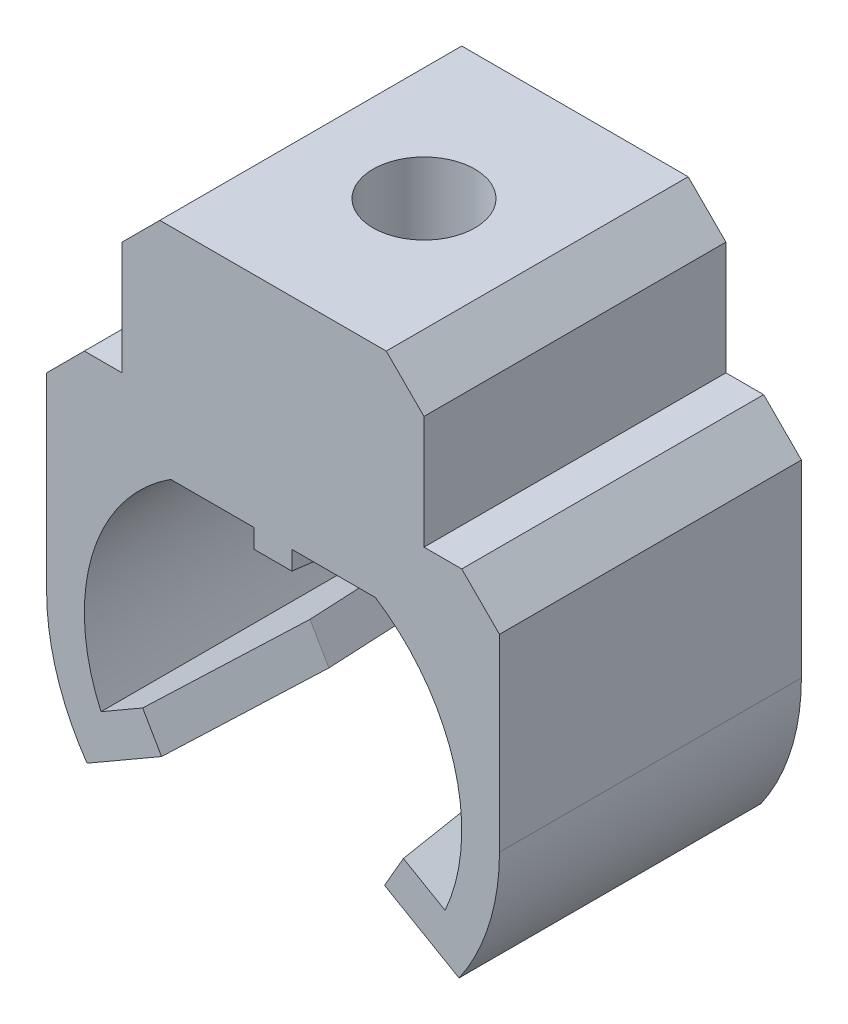
ISO-10303-21;
HEADER;
FILE_DESCRIPTION(('STEP AP214'),'2;1');
FILE_NAME('part.step','',(''),(''),'','','');
FILE_SCHEMA(('AUTOMOTIVE_DESIGN { 1 0 10303 214 1 1 1 1 }'));
ENDSEC;
DATA;
#1=APPLICATION_CONTEXT('core data for automotive mechanical design processes');
#2=APPLICATION_PROTOCOL_DEFINITION('international standard','automotive_design',2000,#1);
#3=PRODUCT_CONTEXT('',#1,'mechanical');
#4=PRODUCT('Part','Part','',(#3));
#5=PRODUCT_RELATED_PRODUCT_CATEGORY('part','',(#4));
#6=PRODUCT_DEFINITION_FORMATION('','',#4);
#7=PRODUCT_DEFINITION_CONTEXT('part definition',#1,'design');
#8=PRODUCT_DEFINITION('design','',#6,#7);
#9=PRODUCT_DEFINITION_SHAPE('','',#8);
#10=(LENGTH_UNIT() NAMED_UNIT(*) SI_UNIT(.MILLI.,.METRE.));
#11=(NAMED_UNIT(*) PLANE_ANGLE_UNIT() SI_UNIT($,.RADIAN.));
#12=(NAMED_UNIT(*) SI_UNIT($,.STERADIAN.) SOLID_ANGLE_UNIT());
#13=UNCERTAINTY_MEASURE_WITH_UNIT(LENGTH_MEASURE(1.E-05),#10,'distance_accuracy_value','');
#14=(GEOMETRIC_REPRESENTATION_CONTEXT(3) GLOBAL_UNCERTAINTY_ASSIGNED_CONTEXT((#13)) GLOBAL_UNIT_ASSIGNED_CONTEXT((#10,
#11,#12)) REPRESENTATION_CONTEXT('',''));
#15=CARTESIAN_POINT('',(0.,0.,0.));
#16=DIRECTION('',(0.,0.,1.));
#17=DIRECTION('',(1.,0.,0.));
#18=AXIS2_PLACEMENT_3D('',#15,#16,#17);
#19=CARTESIAN_POINT('',(0.,0.,8.));
#20=DIRECTION('',(0.,0.,-1.));
#21=DIRECTION('',(-1.,0.,0.));
#22=AXIS2_PLACEMENT_3D('',#19,#20,#21);
#23=CYLINDRICAL_SURFACE('',#22,5.);
#24=CARTESIAN_POINT('',(0.,0.,0.));
#25=DIRECTION('',(0.,0.,-1.));
#26=DIRECTION('',(1.,0.,0.));
#27=AXIS2_PLACEMENT_3D('',#24,#25,#26);
#28=CIRCLE('',#27,5.);
#29=CARTESIAN_POINT('',(2.71293199325011,4.2,0.));
#30=VERTEX_POINT('',#29);
#31=CARTESIAN_POINT('',(4.55842198490352,-2.05445589087434,0.));
#32=VERTEX_POINT('',#31);
#33=EDGE_CURVE('E251',#30,#32,#28,.T.);
#34=ORIENTED_EDGE('',*,*,#33,.T.);
#35=DIRECTION('',(0.,0.,-1.));
#36=VECTOR('',#35,1.);
#37=CARTESIAN_POINT('',(4.55842198490352,-2.05445589087434,8.));
#38=LINE('',#37,#36);
#39=CARTESIAN_POINT('',(4.55842198490352,-2.05445589087434,8.));
#40=VERTEX_POINT('',#39);
#41=EDGE_CURVE('E231',#40,#32,#38,.T.);
#42=ORIENTED_EDGE('',*,*,#41,.F.);
#43=CARTESIAN_POINT('',(0.,0.,8.));
#44=DIRECTION('',(0.,0.,-1.));
#45=DIRECTION('',(1.,0.,0.));
#46=AXIS2_PLACEMENT_3D('',#43,#44,#45);
#47=CIRCLE('',#46,5.);
#48=CARTESIAN_POINT('',(2.71293199325011,4.2,8.));
#49=VERTEX_POINT('',#48);
#50=EDGE_CURVE('E238',#49,#40,#47,.T.);
#51=ORIENTED_EDGE('',*,*,#50,.F.);
#52=DIRECTION('',(0.,0.,-1.));
#53=VECTOR('',#52,1.);
#54=CARTESIAN_POINT('',(2.71293199325011,4.2,8.));
#55=LINE('',#54,#53);
#56=EDGE_CURVE('E363',#49,#30,#55,.T.);
#57=ORIENTED_EDGE('',*,*,#56,.T.);
#58=EDGE_LOOP('',(#34,#42,#51,#57));
#59=FACE_BOUND('',#58,.T.);
#60=ADVANCED_FACE('F33',(#59),#23,.F.);
#61=CARTESIAN_POINT('',(3.0212812921102,-1.16698729810779,8.));
#62=DIRECTION('',(-0.500000000000001,-0.866025403784438,0.));
#63=DIRECTION('',(0.866025403784438,-0.500000000000001,0.));
#64=AXIS2_PLACEMENT_3D('',#61,#62,#63);
#65=PLANE('',#64);
#66=DIRECTION('',(-0.866025403784438,0.500000000000001,0.));
#67=VECTOR('',#66,1.);
#68=CARTESIAN_POINT('',(3.0212812921102,-1.16698729810779,0.));
#69=LINE('',#68,#67);
#70=CARTESIAN_POINT('',(3.45429399400242,-1.41698729810779,0.));
#71=VERTEX_POINT('',#70);
#72=EDGE_CURVE('E370',#32,#71,#69,.T.);
#73=ORIENTED_EDGE('',*,*,#72,.T.);
#74=DIRECTION('',(0.107417231105915,-0.0620173672946044,-0.992277876713668));
#75=VECTOR('',#74,1.);
#76=CARTESIAN_POINT('',(3.0212812921102,-1.16698729810779,4.));
#77=LINE('',#76,#75);
#78=CARTESIAN_POINT('',(3.0212812921102,-1.16698729810779,3.99999999999988));
#79=VERTEX_POINT('',#78);
#80=EDGE_CURVE('E303',#71,#79,#77,.F.);
#81=ORIENTED_EDGE('',*,*,#80,.T.);
#82=DIRECTION('',(0.107417231105912,-0.0620173672946027,0.992277876713668));
#83=VECTOR('',#82,1.);
#84=CARTESIAN_POINT('',(3.45429399400242,-1.41698729810779,8.));
#85=LINE('',#84,#83);
#86=CARTESIAN_POINT('',(3.45429399400242,-1.41698729810779,8.));
#87=VERTEX_POINT('',#86);
#88=EDGE_CURVE('E234',#79,#87,#85,.T.);
#89=ORIENTED_EDGE('',*,*,#88,.T.);
#90=DIRECTION('',(-0.866025403784438,0.500000000000001,0.));
#91=VECTOR('',#90,1.);
#92=CARTESIAN_POINT('',(3.0212812921102,-1.16698729810779,8.));
#93=LINE('',#92,#91);
#94=EDGE_CURVE('E226',#40,#87,#93,.T.);
#95=ORIENTED_EDGE('',*,*,#94,.F.);
#96=ORIENTED_EDGE('',*,*,#41,.T.);
#97=EDGE_LOOP('',(#73,#81,#89,#95,#96));
#98=FACE_BOUND('',#97,.T.);
#99=ADVANCED_FACE('F229',(#98),#65,.F.);
#100=CARTESIAN_POINT('',(2.5212812921102,-2.03301270189222,8.));
#101=DIRECTION('',(0.499999999999998,0.86602540378444,0.));
#102=DIRECTION('',(-0.86602540378444,0.499999999999998,0.));
#103=AXIS2_PLACEMENT_3D('',#100,#101,#102);
#104=PLANE('',#103);
#105=DIRECTION('',(-0.107417231105912,0.0620173672946023,-0.992277876713668));
#106=VECTOR('',#105,1.);
#107=CARTESIAN_POINT('',(2.95429399400242,-2.28301270189222,8.));
#108=LINE('',#107,#106);
#109=CARTESIAN_POINT('',(2.95429399400242,-2.28301270189222,8.));
#110=VERTEX_POINT('',#109);
#111=CARTESIAN_POINT('',(2.5212812921102,-2.03301270189222,3.99999999999988));
#112=VERTEX_POINT('',#111);
#113=EDGE_CURVE('E295',#110,#112,#108,.T.);
#114=ORIENTED_EDGE('',*,*,#113,.T.);
#115=DIRECTION('',(-0.107417231105915,0.062017367294604,0.992277876713668));
#116=VECTOR('',#115,1.);
#117=CARTESIAN_POINT('',(2.5212812921102,-2.03301270189222,4.));
#118=LINE('',#117,#116);
#119=CARTESIAN_POINT('',(2.95429399400242,-2.28301270189222,0.));
#120=VERTEX_POINT('',#119);
#121=EDGE_CURVE('E297',#112,#120,#118,.F.);
#122=ORIENTED_EDGE('',*,*,#121,.T.);
#123=DIRECTION('',(0.86602540378444,-0.499999999999998,0.));
#124=VECTOR('',#123,1.);
#125=CARTESIAN_POINT('',(2.5212812921102,-2.03301270189222,0.));
#126=LINE('',#125,#124);
#127=CARTESIAN_POINT('',(4.928078794302,-3.42257788766757,0.));
#128=VERTEX_POINT('',#127);
#129=EDGE_CURVE('E373',#120,#128,#126,.T.);
#130=ORIENTED_EDGE('',*,*,#129,.T.);
#131=DIRECTION('',(0.,0.,-1.));
#132=VECTOR('',#131,1.);
#133=CARTESIAN_POINT('',(4.928078794302,-3.42257788766757,8.));
#134=LINE('',#133,#132);
#135=CARTESIAN_POINT('',(4.928078794302,-3.42257788766757,8.));
#136=VERTEX_POINT('',#135);
#137=EDGE_CURVE('E253',#136,#128,#134,.T.);
#138=ORIENTED_EDGE('',*,*,#137,.F.);
#139=DIRECTION('',(0.86602540378444,-0.499999999999998,0.));
#140=VECTOR('',#139,1.);
#141=CARTESIAN_POINT('',(2.5212812921102,-2.03301270189222,8.));
#142=LINE('',#141,#140);
#143=EDGE_CURVE('E237',#110,#136,#142,.T.);
#144=ORIENTED_EDGE('',*,*,#143,.F.);
#145=EDGE_LOOP('',(#114,#122,#130,#138,#144));
#146=FACE_BOUND('',#145,.T.);
#147=ADVANCED_FACE('F558',(#146),#104,.F.);
#148=CARTESIAN_POINT('',(0.,0.,8.));
#149=DIRECTION('',(0.,0.,-1.));
#150=DIRECTION('',(-1.,0.,0.));
#151=AXIS2_PLACEMENT_3D('',#148,#149,#150);
#152=CYLINDRICAL_SURFACE('',#151,6.);
#153=CARTESIAN_POINT('',(0.,0.,0.));
#154=DIRECTION('',(0.,0.,1.));
#155=DIRECTION('',(1.,0.,0.));
#156=AXIS2_PLACEMENT_3D('',#153,#154,#155);
#157=CIRCLE('',#156,6.);
#158=CARTESIAN_POINT('',(6.,0.,0.));
#159=VERTEX_POINT('',#158);
#160=EDGE_CURVE('E375',#128,#159,#157,.T.);
#161=ORIENTED_EDGE('',*,*,#160,.T.);
#162=DIRECTION('',(0.,0.,-1.));
#163=VECTOR('',#162,1.);
#164=CARTESIAN_POINT('',(6.,0.,8.));
#165=LINE('',#164,#163);
#166=CARTESIAN_POINT('',(6.,0.,8.));
#167=VERTEX_POINT('',#166);
#168=EDGE_CURVE('E259',#167,#159,#165,.T.);
#169=ORIENTED_EDGE('',*,*,#168,.F.);
#170=CARTESIAN_POINT('',(0.,0.,8.));
#171=DIRECTION('',(0.,0.,1.));
#172=DIRECTION('',(1.,0.,0.));
#173=AXIS2_PLACEMENT_3D('',#170,#171,#172);
#174=CIRCLE('',#173,6.);
#175=EDGE_CURVE('E458',#136,#167,#174,.T.);
#176=ORIENTED_EDGE('',*,*,#175,.F.);
#177=ORIENTED_EDGE('',*,*,#137,.T.);
#178=EDGE_LOOP('',(#161,#169,#176,#177));
#179=FACE_BOUND('',#178,.T.);
#180=ADVANCED_FACE('F686',(#179),#152,.T.);
#181=CARTESIAN_POINT('',(6.,0.,8.));
#182=DIRECTION('',(-1.,0.,0.));
#183=DIRECTION('',(0.,0.,1.));
#184=AXIS2_PLACEMENT_3D('',#181,#182,#183);
#185=PLANE('',#184);
#186=DIRECTION('',(0.,1.,0.));
#187=VECTOR('',#186,1.);
#188=CARTESIAN_POINT('',(6.,0.,0.));
#189=LINE('',#188,#187);
#190=CARTESIAN_POINT('',(6.,5.00000000000001,0.));
#191=VERTEX_POINT('',#190);
#192=EDGE_CURVE('E377',#159,#191,#189,.T.);
#193=ORIENTED_EDGE('',*,*,#192,.T.);
#194=DIRECTION('',(0.,0.,1.));
#195=VECTOR('',#194,1.);
#196=CARTESIAN_POINT('',(6.,5.00000000000001,8.));
#197=LINE('',#196,#195);
#198=CARTESIAN_POINT('',(6.,5.00000000000001,8.));
#199=VERTEX_POINT('',#198);
#200=EDGE_CURVE('E288',#191,#199,#197,.T.);
#201=ORIENTED_EDGE('',*,*,#200,.T.);
#202=DIRECTION('',(0.,1.,0.));
#203=VECTOR('',#202,1.);
#204=CARTESIAN_POINT('',(6.,0.,8.));
#205=LINE('',#204,#203);
#206=EDGE_CURVE('E436',#167,#199,#205,.T.);
#207=ORIENTED_EDGE('',*,*,#206,.F.);
#208=ORIENTED_EDGE('',*,*,#168,.T.);
#209=EDGE_LOOP('',(#193,#201,#207,#208));
#210=FACE_BOUND('',#209,.T.);
#211=ADVANCED_FACE('F433',(#210),#185,.F.);
#212=CARTESIAN_POINT('',(4.,6.00000000000001,8.));
#213=DIRECTION('',(0.,-1.,0.));
#214=DIRECTION('',(1.,0.,0.));
#215=AXIS2_PLACEMENT_3D('',#212,#213,#214);
#216=PLANE('',#215);
#217=DIRECTION('',(-1.,0.,0.));
#218=VECTOR('',#217,1.);
#219=CARTESIAN_POINT('',(4.,6.00000000000001,8.));
#220=LINE('',#219,#218);
#221=CARTESIAN_POINT('',(5.,6.00000000000001,8.));
#222=VERTEX_POINT('',#221);
#223=CARTESIAN_POINT('',(4.,6.00000000000001,8.));
#224=VERTEX_POINT('',#223);
#225=EDGE_CURVE('E451',#222,#224,#220,.T.);
#226=ORIENTED_EDGE('',*,*,#225,.F.);
#227=DIRECTION('',(0.,0.,-1.));
#228=VECTOR('',#227,1.);
#229=CARTESIAN_POINT('',(5.,6.00000000000001,8.));
#230=LINE('',#229,#228);
#231=CARTESIAN_POINT('',(5.,6.00000000000001,0.));
#232=VERTEX_POINT('',#231);
#233=EDGE_CURVE('E285',#222,#232,#230,.T.);
#234=ORIENTED_EDGE('',*,*,#233,.T.);
#235=DIRECTION('',(-1.,0.,0.));
#236=VECTOR('',#235,1.);
#237=CARTESIAN_POINT('',(4.,6.00000000000001,0.));
#238=LINE('',#237,#236);
#239=CARTESIAN_POINT('',(4.,6.00000000000001,0.));
#240=VERTEX_POINT('',#239);
#241=EDGE_CURVE('E380',#232,#240,#238,.T.);
#242=ORIENTED_EDGE('',*,*,#241,.T.);
#243=DIRECTION('',(0.,0.,-1.));
#244=VECTOR('',#243,1.);
#245=CARTESIAN_POINT('',(4.,6.00000000000001,8.));
#246=LINE('',#245,#244);
#247=EDGE_CURVE('E426',#224,#240,#246,.T.);
#248=ORIENTED_EDGE('',*,*,#247,.F.);
#249=EDGE_LOOP('',(#226,#234,#242,#248));
#250=FACE_BOUND('',#249,.T.);
#251=ADVANCED_FACE('F449',(#250),#216,.F.);
#252=CARTESIAN_POINT('',(4.,9.99999999999999,8.));
#253=DIRECTION('',(-1.,0.,0.));
#254=DIRECTION('',(0.,-1.,0.));
#255=AXIS2_PLACEMENT_3D('',#252,#253,#254);
#256=PLANE('',#255);
#257=DIRECTION('',(0.,1.,0.));
#258=VECTOR('',#257,1.);
#259=CARTESIAN_POINT('',(4.,9.99999999999999,0.));
#260=LINE('',#259,#258);
#261=CARTESIAN_POINT('',(4.,8.99999999999998,0.));
#262=VERTEX_POINT('',#261);
#263=EDGE_CURVE('E382',#240,#262,#260,.T.);
#264=ORIENTED_EDGE('',*,*,#263,.T.);
#265=DIRECTION('',(0.,0.,1.));
#266=VECTOR('',#265,1.);
#267=CARTESIAN_POINT('',(4.,8.99999999999998,8.));
#268=LINE('',#267,#266);
#269=CARTESIAN_POINT('',(4.,8.99999999999999,8.));
#270=VERTEX_POINT('',#269);
#271=EDGE_CURVE('E283',#262,#270,#268,.T.);
#272=ORIENTED_EDGE('',*,*,#271,.T.);
#273=DIRECTION('',(0.,1.,0.));
#274=VECTOR('',#273,1.);
#275=CARTESIAN_POINT('',(4.,9.99999999999999,8.));
#276=LINE('',#275,#274);
#277=EDGE_CURVE('E454',#224,#270,#276,.T.);
#278=ORIENTED_EDGE('',*,*,#277,.F.);
#279=ORIENTED_EDGE('',*,*,#247,.T.);
#280=EDGE_LOOP('',(#264,#272,#278,#279));
#281=FACE_BOUND('',#280,.T.);
#282=ADVANCED_FACE('F543',(#281),#256,.F.);
#283=CARTESIAN_POINT('',(-4.,9.99999999999999,8.));
#284=DIRECTION('',(0.,-1.,0.));
#285=DIRECTION('',(0.,0.,-1.));
#286=AXIS2_PLACEMENT_3D('',#283,#284,#285);
#287=PLANE('',#286);
#288=CARTESIAN_POINT('',(0.,9.99999999999999,4.));
#289=DIRECTION('',(0.,1.,0.));
#290=DIRECTION('',(0.,0.,1.));
#291=AXIS2_PLACEMENT_3D('',#288,#289,#290);
#292=CIRCLE('',#291,1.35);
#293=CARTESIAN_POINT('',(0.,9.99999999999999,5.35));
#294=VERTEX_POINT('',#293);
#295=EDGE_CURVE('E333',#294,#294,#292,.T.);
#296=ORIENTED_EDGE('',*,*,#295,.F.);
#297=EDGE_LOOP('',(#296));
#298=FACE_BOUND('',#297,.T.);
#299=DIRECTION('',(-1.,0.,0.));
#300=VECTOR('',#299,1.);
#301=CARTESIAN_POINT('',(-4.,9.99999999999999,0.));
#302=LINE('',#301,#300);
#303=CARTESIAN_POINT('',(2.99999999999999,9.99999999999999,0.));
#304=VERTEX_POINT('',#303);
#305=CARTESIAN_POINT('',(-3.,9.99999999999999,0.));
#306=VERTEX_POINT('',#305);
#307=EDGE_CURVE('E385',#304,#306,#302,.T.);
#308=ORIENTED_EDGE('',*,*,#307,.T.);
#309=DIRECTION('',(0.,0.,1.));
#310=VECTOR('',#309,1.);
#311=CARTESIAN_POINT('',(-3.,9.99999999999999,8.));
#312=LINE('',#311,#310);
#313=CARTESIAN_POINT('',(-3.,9.99999999999999,8.));
#314=VERTEX_POINT('',#313);
#315=EDGE_CURVE('E273',#306,#314,#312,.T.);
#316=ORIENTED_EDGE('',*,*,#315,.T.);
#317=DIRECTION('',(-1.,0.,0.));
#318=VECTOR('',#317,1.);
#319=CARTESIAN_POINT('',(-4.,9.99999999999999,8.));
#320=LINE('',#319,#318);
#321=CARTESIAN_POINT('',(2.99999999999999,9.99999999999999,8.));
#322=VERTEX_POINT('',#321);
#323=EDGE_CURVE('E456',#322,#314,#320,.T.);
#324=ORIENTED_EDGE('',*,*,#323,.F.);
#325=DIRECTION('',(0.,0.,-1.));
#326=VECTOR('',#325,1.);
#327=CARTESIAN_POINT('',(2.99999999999999,9.99999999999999,8.));
#328=LINE('',#327,#326);
#329=EDGE_CURVE('E270',#322,#304,#328,.T.);
#330=ORIENTED_EDGE('',*,*,#329,.T.);
#331=EDGE_LOOP('',(#308,#316,#324,#330));
#332=FACE_BOUND('',#331,.T.);
#333=ADVANCED_FACE('F533',(#298,#332),#287,.F.);
#334=CARTESIAN_POINT('',(-4.,5.99999999999999,8.));
#335=DIRECTION('',(1.,0.,0.));
#336=DIRECTION('',(0.,1.,0.));
#337=AXIS2_PLACEMENT_3D('',#334,#335,#336);
#338=PLANE('',#337);
#339=DIRECTION('',(0.,-1.,0.));
#340=VECTOR('',#339,1.);
#341=CARTESIAN_POINT('',(-4.,5.99999999999999,8.));
#342=LINE('',#341,#340);
#343=CARTESIAN_POINT('',(-4.,8.99999999999999,8.));
#344=VERTEX_POINT('',#343);
#345=CARTESIAN_POINT('',(-4.,5.99999999999999,8.));
#346=VERTEX_POINT('',#345);
#347=EDGE_CURVE('E464',#344,#346,#342,.T.);
#348=ORIENTED_EDGE('',*,*,#347,.F.);
#349=DIRECTION('',(0.,0.,-1.));
#350=VECTOR('',#349,1.);
#351=CARTESIAN_POINT('',(-4.,8.99999999999999,8.));
#352=LINE('',#351,#350);
#353=CARTESIAN_POINT('',(-4.,8.99999999999999,0.));
#354=VERTEX_POINT('',#353);
#355=EDGE_CURVE('E252',#344,#354,#352,.T.);
#356=ORIENTED_EDGE('',*,*,#355,.T.);
#357=DIRECTION('',(0.,-1.,0.));
#358=VECTOR('',#357,1.);
#359=CARTESIAN_POINT('',(-4.,5.99999999999999,0.));
#360=LINE('',#359,#358);
#361=CARTESIAN_POINT('',(-4.,5.99999999999999,0.));
#362=VERTEX_POINT('',#361);
#363=EDGE_CURVE('E388',#354,#362,#360,.T.);
#364=ORIENTED_EDGE('',*,*,#363,.T.);
#365=DIRECTION('',(0.,0.,-1.));
#366=VECTOR('',#365,1.);
#367=CARTESIAN_POINT('',(-4.,5.99999999999999,8.));
#368=LINE('',#367,#366);
#369=EDGE_CURVE('E423',#346,#362,#368,.T.);
#370=ORIENTED_EDGE('',*,*,#369,.F.);
#371=EDGE_LOOP('',(#348,#356,#364,#370));
#372=FACE_BOUND('',#371,.T.);
#373=ADVANCED_FACE('F527',(#372),#338,.F.);
#374=CARTESIAN_POINT('',(-6.,5.99999999999999,8.));
#375=DIRECTION('',(0.,-1.,0.));
#376=DIRECTION('',(1.,0.,0.));
#377=AXIS2_PLACEMENT_3D('',#374,#375,#376);
#378=PLANE('',#377);
#379=DIRECTION('',(-1.,0.,0.));
#380=VECTOR('',#379,1.);
#381=CARTESIAN_POINT('',(-6.,5.99999999999999,0.));
#382=LINE('',#381,#380);
#383=CARTESIAN_POINT('',(-5.,5.99999999999999,0.));
#384=VERTEX_POINT('',#383);
#385=EDGE_CURVE('E390',#362,#384,#382,.T.);
#386=ORIENTED_EDGE('',*,*,#385,.T.);
#387=DIRECTION('',(0.,0.,1.));
#388=VECTOR('',#387,1.);
#389=CARTESIAN_POINT('',(-5.,5.99999999999999,8.));
#390=LINE('',#389,#388);
#391=CARTESIAN_POINT('',(-5.,5.99999999999999,8.));
#392=VERTEX_POINT('',#391);
#393=EDGE_CURVE('E293',#384,#392,#390,.T.);
#394=ORIENTED_EDGE('',*,*,#393,.T.);
#395=DIRECTION('',(-1.,0.,0.));
#396=VECTOR('',#395,1.);
#397=CARTESIAN_POINT('',(-6.,5.99999999999999,8.));
#398=LINE('',#397,#396);
#399=EDGE_CURVE('E466',#346,#392,#398,.T.);
#400=ORIENTED_EDGE('',*,*,#399,.F.);
#401=ORIENTED_EDGE('',*,*,#369,.T.);
#402=EDGE_LOOP('',(#386,#394,#400,#401));
#403=FACE_BOUND('',#402,.T.);
#404=ADVANCED_FACE('F522',(#403),#378,.F.);
#405=CARTESIAN_POINT('',(-6.,0.,8.));
#406=DIRECTION('',(1.,0.,0.));
#407=DIRECTION('',(0.,0.,-1.));
#408=AXIS2_PLACEMENT_3D('',#405,#406,#407);
#409=PLANE('',#408);
#410=DIRECTION('',(0.,-1.,0.));
#411=VECTOR('',#410,1.);
#412=CARTESIAN_POINT('',(-6.,0.,8.));
#413=LINE('',#412,#411);
#414=CARTESIAN_POINT('',(-6.,4.99999999999999,8.));
#415=VERTEX_POINT('',#414);
#416=CARTESIAN_POINT('',(-6.,0.,8.));
#417=VERTEX_POINT('',#416);
#418=EDGE_CURVE('E469',#415,#417,#413,.T.);
#419=ORIENTED_EDGE('',*,*,#418,.F.);
#420=DIRECTION('',(0.,0.,-1.));
#421=VECTOR('',#420,1.);
#422=CARTESIAN_POINT('',(-6.,4.99999999999999,8.));
#423=LINE('',#422,#421);
#424=CARTESIAN_POINT('',(-6.,4.99999999999999,0.));
#425=VERTEX_POINT('',#424);
#426=EDGE_CURVE('E290',#415,#425,#423,.T.);
#427=ORIENTED_EDGE('',*,*,#426,.T.);
#428=DIRECTION('',(0.,-1.,0.));
#429=VECTOR('',#428,1.);
#430=CARTESIAN_POINT('',(-6.,0.,0.));
#431=LINE('',#430,#429);
#432=CARTESIAN_POINT('',(-6.,0.,0.));
#433=VERTEX_POINT('',#432);
#434=EDGE_CURVE('E393',#425,#433,#431,.T.);
#435=ORIENTED_EDGE('',*,*,#434,.T.);
#436=DIRECTION('',(0.,0.,-1.));
#437=VECTOR('',#436,1.);
#438=CARTESIAN_POINT('',(-6.,0.,8.));
#439=LINE('',#438,#437);
#440=EDGE_CURVE('E420',#417,#433,#439,.T.);
#441=ORIENTED_EDGE('',*,*,#440,.F.);
#442=EDGE_LOOP('',(#419,#427,#435,#441));
#443=FACE_BOUND('',#442,.T.);
#444=ADVANCED_FACE('F513',(#443),#409,.F.);
#445=CARTESIAN_POINT('',(0.,0.,8.));
#446=DIRECTION('',(0.,0.,-1.));
#447=DIRECTION('',(-1.,0.,0.));
#448=AXIS2_PLACEMENT_3D('',#445,#446,#447);
#449=CYLINDRICAL_SURFACE('',#448,6.);
#450=CARTESIAN_POINT('',(0.,0.,0.));
#451=DIRECTION('',(0.,0.,1.));
#452=DIRECTION('',(1.,0.,0.));
#453=AXIS2_PLACEMENT_3D('',#450,#451,#452);
#454=CIRCLE('',#453,6.);
#455=CARTESIAN_POINT('',(-4.92807879430202,-3.42257788766754,0.));
#456=VERTEX_POINT('',#455);
#457=EDGE_CURVE('E395',#433,#456,#454,.T.);
#458=ORIENTED_EDGE('',*,*,#457,.T.);
#459=DIRECTION('',(0.,0.,-1.));
#460=VECTOR('',#459,1.);
#461=CARTESIAN_POINT('',(-4.92807879430202,-3.42257788766754,8.));
#462=LINE('',#461,#460);
#463=CARTESIAN_POINT('',(-4.92807879430202,-3.42257788766754,8.));
#464=VERTEX_POINT('',#463);
#465=EDGE_CURVE('E417',#464,#456,#462,.T.);
#466=ORIENTED_EDGE('',*,*,#465,.F.);
#467=CARTESIAN_POINT('',(0.,0.,8.));
#468=DIRECTION('',(0.,0.,1.));
#469=DIRECTION('',(1.,0.,0.));
#470=AXIS2_PLACEMENT_3D('',#467,#468,#469);
#471=CIRCLE('',#470,6.);
#472=EDGE_CURVE('E471',#417,#464,#471,.T.);
#473=ORIENTED_EDGE('',*,*,#472,.F.);
#474=ORIENTED_EDGE('',*,*,#440,.T.);
#475=EDGE_LOOP('',(#458,#466,#473,#474));
#476=FACE_BOUND('',#475,.T.);
#477=ADVANCED_FACE('F509',(#476),#449,.T.);
#478=CARTESIAN_POINT('',(-2.52128129211022,-2.0330127018922,8.));
#479=DIRECTION('',(-0.499999999999995,0.866025403784441,0.));
#480=DIRECTION('',(-0.866025403784442,-0.499999999999995,0.));
#481=AXIS2_PLACEMENT_3D('',#478,#479,#480);
#482=PLANE('',#481);
#483=DIRECTION('',(0.866025403784441,0.499999999999995,0.));
#484=VECTOR('',#483,1.);
#485=CARTESIAN_POINT('',(-2.52128129211022,-2.0330127018922,0.));
#486=LINE('',#485,#484);
#487=CARTESIAN_POINT('',(-2.95429399400244,-2.2830127018922,0.));
#488=VERTEX_POINT('',#487);
#489=EDGE_CURVE('E397',#456,#488,#486,.T.);
#490=ORIENTED_EDGE('',*,*,#489,.T.);
#491=DIRECTION('',(-0.107417231105912,-0.062017367294602,-0.992277876713668));
#492=VECTOR('',#491,1.);
#493=CARTESIAN_POINT('',(-2.52128129211022,-2.0330127018922,4.00000000000011));
#494=LINE('',#493,#492);
#495=CARTESIAN_POINT('',(-2.52128129211022,-2.0330127018922,3.99999999999988));
#496=VERTEX_POINT('',#495);
#497=EDGE_CURVE('E337',#488,#496,#494,.F.);
#498=ORIENTED_EDGE('',*,*,#497,.T.);
#499=DIRECTION('',(-0.107417231105913,-0.062017367294602,0.992277876713668));
#500=VECTOR('',#499,1.);
#501=CARTESIAN_POINT('',(-2.95429399400244,-2.2830127018922,8.));
#502=LINE('',#501,#500);
#503=CARTESIAN_POINT('',(-2.95429399400244,-2.2830127018922,8.));
#504=VERTEX_POINT('',#503);
#505=EDGE_CURVE('E327',#496,#504,#502,.T.);
#506=ORIENTED_EDGE('',*,*,#505,.T.);
#507=DIRECTION('',(0.866025403784441,0.499999999999995,0.));
#508=VECTOR('',#507,1.);
#509=CARTESIAN_POINT('',(-2.52128129211022,-2.0330127018922,8.));
#510=LINE('',#509,#508);
#511=EDGE_CURVE('E473',#464,#504,#510,.T.);
#512=ORIENTED_EDGE('',*,*,#511,.F.);
#513=ORIENTED_EDGE('',*,*,#465,.T.);
#514=EDGE_LOOP('',(#490,#498,#506,#512,#513));
#515=FACE_BOUND('',#514,.T.);
#516=ADVANCED_FACE('F499',(#515),#482,.F.);
#517=CARTESIAN_POINT('',(-3.02128129211021,-1.16698729810776,8.));
#518=DIRECTION('',(0.499999999999995,-0.866025403784442,0.));
#519=DIRECTION('',(0.866025403784442,0.499999999999995,0.));
#520=AXIS2_PLACEMENT_3D('',#517,#518,#519);
#521=PLANE('',#520);
#522=DIRECTION('',(0.107417231105913,0.0620173672946019,-0.992277876713668));
#523=VECTOR('',#522,1.);
#524=CARTESIAN_POINT('',(-3.45429399400243,-1.41698729810776,8.));
#525=LINE('',#524,#523);
#526=CARTESIAN_POINT('',(-3.45429399400243,-1.41698729810776,8.));
#527=VERTEX_POINT('',#526);
#528=CARTESIAN_POINT('',(-3.02128129211021,-1.16698729810776,3.99999999999989));
#529=VERTEX_POINT('',#528);
#530=EDGE_CURVE('E321',#527,#529,#525,.T.);
#531=ORIENTED_EDGE('',*,*,#530,.T.);
#532=DIRECTION('',(0.107417231105912,0.0620173672946019,0.992277876713668));
#533=VECTOR('',#532,1.);
#534=CARTESIAN_POINT('',(-3.02128129211021,-1.16698729810776,4.00000000000011));
#535=LINE('',#534,#533);
#536=CARTESIAN_POINT('',(-3.45429399400243,-1.41698729810776,0.));
#537=VERTEX_POINT('',#536);
#538=EDGE_CURVE('E329',#529,#537,#535,.F.);
#539=ORIENTED_EDGE('',*,*,#538,.T.);
#540=DIRECTION('',(-0.866025403784442,-0.499999999999995,0.));
#541=VECTOR('',#540,1.);
#542=CARTESIAN_POINT('',(-3.02128129211021,-1.16698729810776,0.));
#543=LINE('',#542,#541);
#544=CARTESIAN_POINT('',(-4.55842198490353,-2.0544558908743,0.));
#545=VERTEX_POINT('',#544);
#546=EDGE_CURVE('E399',#537,#545,#543,.T.);
#547=ORIENTED_EDGE('',*,*,#546,.T.);
#548=DIRECTION('',(0.,0.,-1.));
#549=VECTOR('',#548,1.);
#550=CARTESIAN_POINT('',(-4.55842198490353,-2.0544558908743,8.));
#551=LINE('',#550,#549);
#552=CARTESIAN_POINT('',(-4.55842198490353,-2.0544558908743,8.));
#553=VERTEX_POINT('',#552);
#554=EDGE_CURVE('E414',#553,#545,#551,.T.);
#555=ORIENTED_EDGE('',*,*,#554,.F.);
#556=DIRECTION('',(-0.866025403784442,-0.499999999999995,0.));
#557=VECTOR('',#556,1.);
#558=CARTESIAN_POINT('',(-3.02128129211021,-1.16698729810776,8.));
#559=LINE('',#558,#557);
#560=EDGE_CURVE('E476',#527,#553,#559,.T.);
#561=ORIENTED_EDGE('',*,*,#560,.F.);
#562=EDGE_LOOP('',(#531,#539,#547,#555,#561));
#563=FACE_BOUND('',#562,.T.);
#564=ADVANCED_FACE('F492',(#563),#521,.F.);
#565=CARTESIAN_POINT('',(0.,0.,8.));
#566=DIRECTION('',(0.,0.,-1.));
#567=DIRECTION('',(-1.,0.,0.));
#568=AXIS2_PLACEMENT_3D('',#565,#566,#567);
#569=CYLINDRICAL_SURFACE('',#568,5.);
#570=CARTESIAN_POINT('',(0.,0.,0.));
#571=DIRECTION('',(0.,0.,-1.));
#572=DIRECTION('',(1.,0.,0.));
#573=AXIS2_PLACEMENT_3D('',#570,#571,#572);
#574=CIRCLE('',#573,5.);
#575=CARTESIAN_POINT('',(-2.71293199325011,4.2,0.));
#576=VERTEX_POINT('',#575);
#577=EDGE_CURVE('E401',#545,#576,#574,.T.);
#578=ORIENTED_EDGE('',*,*,#577,.T.);
#579=DIRECTION('',(0.,0.,-1.));
#580=VECTOR('',#579,1.);
#581=CARTESIAN_POINT('',(-2.71293199325011,4.2,8.));
#582=LINE('',#581,#580);
#583=CARTESIAN_POINT('',(-2.71293199325011,4.2,8.));
#584=VERTEX_POINT('',#583);
#585=EDGE_CURVE('E411',#584,#576,#582,.T.);
#586=ORIENTED_EDGE('',*,*,#585,.F.);
#587=CARTESIAN_POINT('',(0.,0.,8.));
#588=DIRECTION('',(0.,0.,-1.));
#589=DIRECTION('',(1.,0.,0.));
#590=AXIS2_PLACEMENT_3D('',#587,#588,#589);
#591=CIRCLE('',#590,5.);
#592=EDGE_CURVE('E478',#553,#584,#591,.T.);
#593=ORIENTED_EDGE('',*,*,#592,.F.);
#594=ORIENTED_EDGE('',*,*,#554,.T.);
#595=EDGE_LOOP('',(#578,#586,#593,#594));
#596=FACE_BOUND('',#595,.T.);
#597=ADVANCED_FACE('F488',(#596),#569,.F.);
#598=CARTESIAN_POINT('',(-2.71293199325011,4.2,8.));
#599=DIRECTION('',(0.,1.,0.));
#600=DIRECTION('',(0.,0.,1.));
#601=AXIS2_PLACEMENT_3D('',#598,#599,#600);
#602=PLANE('',#601);
#603=DIRECTION('',(1.,0.,0.));
#604=VECTOR('',#603,1.);
#605=CARTESIAN_POINT('',(-2.71293199325011,4.2,0.));
#606=LINE('',#605,#604);
#607=CARTESIAN_POINT('',(-0.5,4.2,0.));
#608=VERTEX_POINT('',#607);
#609=EDGE_CURVE('E403',#576,#608,#606,.T.);
#610=ORIENTED_EDGE('',*,*,#609,.T.);
#611=DIRECTION('',(0.,0.,-1.));
#612=VECTOR('',#611,1.);
#613=CARTESIAN_POINT('',(-0.5,4.2,8.));
#614=LINE('',#613,#612);
#615=CARTESIAN_POINT('',(-0.5,4.2,8.));
#616=VERTEX_POINT('',#615);
#617=EDGE_CURVE('E409',#616,#608,#614,.T.);
#618=ORIENTED_EDGE('',*,*,#617,.F.);
#619=DIRECTION('',(1.,0.,0.));
#620=VECTOR('',#619,1.);
#621=CARTESIAN_POINT('',(-2.71293199325011,4.2,8.));
#622=LINE('',#621,#620);
#623=EDGE_CURVE('E365',#584,#616,#622,.T.);
#624=ORIENTED_EDGE('',*,*,#623,.F.);
#625=ORIENTED_EDGE('',*,*,#585,.T.);
#626=EDGE_LOOP('',(#610,#618,#624,#625));
#627=FACE_BOUND('',#626,.T.);
#628=ADVANCED_FACE('F484',(#627),#602,.F.);
#629=CARTESIAN_POINT('',(-0.5,3.2,8.));
#630=DIRECTION('',(1.,0.,0.));
#631=DIRECTION('',(0.,0.,-1.));
#632=AXIS2_PLACEMENT_3D('',#629,#630,#631);
#633=PLANE('',#632);
#634=DIRECTION('',(0.,-1.,0.));
#635=VECTOR('',#634,1.);
#636=CARTESIAN_POINT('',(-0.5,3.2,0.));
#637=LINE('',#636,#635);
#638=CARTESIAN_POINT('',(-0.5,3.7,0.));
#639=VERTEX_POINT('',#638);
#640=EDGE_CURVE('E348',#608,#639,#637,.T.);
#641=ORIENTED_EDGE('',*,*,#640,.T.);
#642=DIRECTION('',(0.,0.124034734589205,-0.992277876713668));
#643=VECTOR('',#642,1.);
#644=CARTESIAN_POINT('',(-0.5,3.2,4.00000000000011));
#645=LINE('',#644,#643);
#646=CARTESIAN_POINT('',(-0.5,3.2,3.99999999999989));
#647=VERTEX_POINT('',#646);
#648=EDGE_CURVE('E11',#639,#647,#645,.F.);
#649=ORIENTED_EDGE('',*,*,#648,.T.);
#650=DIRECTION('',(0.,0.124034734589205,0.992277876713668));
#651=VECTOR('',#650,1.);
#652=CARTESIAN_POINT('',(-0.5,3.7,8.));
#653=LINE('',#652,#651);
#654=CARTESIAN_POINT('',(-0.5,3.7,8.));
#655=VERTEX_POINT('',#654);
#656=EDGE_CURVE('E319',#647,#655,#653,.T.);
#657=ORIENTED_EDGE('',*,*,#656,.T.);
#658=DIRECTION('',(0.,-1.,0.));
#659=VECTOR('',#658,1.);
#660=CARTESIAN_POINT('',(-0.5,3.2,8.));
#661=LINE('',#660,#659);
#662=EDGE_CURVE('E360',#616,#655,#661,.T.);
#663=ORIENTED_EDGE('',*,*,#662,.F.);
#664=ORIENTED_EDGE('',*,*,#617,.T.);
#665=EDGE_LOOP('',(#641,#649,#657,#663,#664));
#666=FACE_BOUND('',#665,.T.);
#667=ADVANCED_FACE('F353',(#666),#633,.F.);
#668=CARTESIAN_POINT('',(0.5,3.2,8.));
#669=DIRECTION('',(-1.,0.,0.));
#670=DIRECTION('',(0.,0.,1.));
#671=AXIS2_PLACEMENT_3D('',#668,#669,#670);
#672=PLANE('',#671);
#673=DIRECTION('',(0.,-0.124034734589205,-0.992277876713668));
#674=VECTOR('',#673,1.);
#675=CARTESIAN_POINT('',(0.5,3.7,8.));
#676=LINE('',#675,#674);
#677=CARTESIAN_POINT('',(0.5,3.7,8.));
#678=VERTEX_POINT('',#677);
#679=CARTESIAN_POINT('',(0.5,3.2,3.99999999999989));
#680=VERTEX_POINT('',#679);
#681=EDGE_CURVE('E313',#678,#680,#676,.T.);
#682=ORIENTED_EDGE('',*,*,#681,.T.);
#683=DIRECTION('',(0.,-0.124034734589205,0.992277876713668));
#684=VECTOR('',#683,1.);
#685=CARTESIAN_POINT('',(0.5,3.2,4.00000000000011));
#686=LINE('',#685,#684);
#687=CARTESIAN_POINT('',(0.5,3.7,0.));
#688=VERTEX_POINT('',#687);
#689=EDGE_CURVE('E41',#680,#688,#686,.F.);
#690=ORIENTED_EDGE('',*,*,#689,.T.);
#691=DIRECTION('',(0.,1.,0.));
#692=VECTOR('',#691,1.);
#693=CARTESIAN_POINT('',(0.5,3.2,0.));
#694=LINE('',#693,#692);
#695=CARTESIAN_POINT('',(0.5,4.2,0.));
#696=VERTEX_POINT('',#695);
#697=EDGE_CURVE('E341',#688,#696,#694,.T.);
#698=ORIENTED_EDGE('',*,*,#697,.T.);
#699=DIRECTION('',(0.,0.,-1.));
#700=VECTOR('',#699,1.);
#701=CARTESIAN_POINT('',(0.5,4.2,8.));
#702=LINE('',#701,#700);
#703=CARTESIAN_POINT('',(0.5,4.2,8.));
#704=VERTEX_POINT('',#703);
#705=EDGE_CURVE('E361',#704,#696,#702,.T.);
#706=ORIENTED_EDGE('',*,*,#705,.F.);
#707=DIRECTION('',(0.,1.,0.));
#708=VECTOR('',#707,1.);
#709=CARTESIAN_POINT('',(0.5,3.2,8.));
#710=LINE('',#709,#708);
#711=EDGE_CURVE('E359',#678,#704,#710,.T.);
#712=ORIENTED_EDGE('',*,*,#711,.F.);
#713=EDGE_LOOP('',(#682,#690,#698,#706,#712));
#714=FACE_BOUND('',#713,.T.);
#715=ADVANCED_FACE('F339',(#714),#672,.F.);
#716=CARTESIAN_POINT('',(0.5,4.2,8.));
#717=DIRECTION('',(0.,1.,0.));
#718=DIRECTION('',(0.,0.,1.));
#719=AXIS2_PLACEMENT_3D('',#716,#717,#718);
#720=PLANE('',#719);
#721=DIRECTION('',(1.,0.,0.));
#722=VECTOR('',#721,1.);
#723=CARTESIAN_POINT('',(0.5,4.2,0.));
#724=LINE('',#723,#722);
#725=EDGE_CURVE('E248',#696,#30,#724,.T.);
#726=ORIENTED_EDGE('',*,*,#725,.T.);
#727=ORIENTED_EDGE('',*,*,#56,.F.);
#728=DIRECTION('',(1.,0.,0.));
#729=VECTOR('',#728,1.);
#730=CARTESIAN_POINT('',(0.5,4.2,8.));
#731=LINE('',#730,#729);
#732=EDGE_CURVE('E244',#704,#49,#731,.T.);
#733=ORIENTED_EDGE('',*,*,#732,.F.);
#734=ORIENTED_EDGE('',*,*,#705,.T.);
#735=EDGE_LOOP('',(#726,#727,#733,#734));
#736=FACE_BOUND('',#735,.T.);
#737=ADVANCED_FACE('F627',(#736),#720,.F.);
#738=CARTESIAN_POINT('',(0.,0.,8.));
#739=DIRECTION('',(0.,0.,1.));
#740=DIRECTION('',(1.,0.,0.));
#741=AXIS2_PLACEMENT_3D('',#738,#739,#740);
#742=PLANE('',#741);
#743=ORIENTED_EDGE('',*,*,#662,.T.);
#744=DIRECTION('',(1.,0.,0.));
#745=VECTOR('',#744,1.);
#746=CARTESIAN_POINT('',(0.5,3.7,8.));
#747=LINE('',#746,#745);
#748=EDGE_CURVE('E310',#655,#678,#747,.T.);
#749=ORIENTED_EDGE('',*,*,#748,.T.);
#750=ORIENTED_EDGE('',*,*,#711,.T.);
#751=ORIENTED_EDGE('',*,*,#732,.T.);
#752=ORIENTED_EDGE('',*,*,#50,.T.);
#753=ORIENTED_EDGE('',*,*,#94,.T.);
#754=DIRECTION('',(-0.500000000000001,-0.866025403784438,0.));
#755=VECTOR('',#754,1.);
#756=CARTESIAN_POINT('',(2.95429399400242,-2.28301270189223,8.));
#757=LINE('',#756,#755);
#758=EDGE_CURVE('E305',#87,#110,#757,.T.);
#759=ORIENTED_EDGE('',*,*,#758,.T.);
#760=ORIENTED_EDGE('',*,*,#143,.T.);
#761=ORIENTED_EDGE('',*,*,#175,.T.);
#762=ORIENTED_EDGE('',*,*,#206,.T.);
#763=DIRECTION('',(0.707106781186546,-0.707106781186549,0.));
#764=VECTOR('',#763,1.);
#765=CARTESIAN_POINT('',(5.50000000000001,5.5,8.));
#766=LINE('',#765,#764);
#767=EDGE_CURVE('E277',#199,#222,#766,.F.);
#768=ORIENTED_EDGE('',*,*,#767,.T.);
#769=ORIENTED_EDGE('',*,*,#225,.T.);
#770=ORIENTED_EDGE('',*,*,#277,.T.);
#771=DIRECTION('',(0.707106781186546,-0.707106781186549,0.));
#772=VECTOR('',#771,1.);
#773=CARTESIAN_POINT('',(6.5,6.49999999999998,8.));
#774=LINE('',#773,#772);
#775=EDGE_CURVE('E279',#270,#322,#774,.F.);
#776=ORIENTED_EDGE('',*,*,#775,.T.);
#777=ORIENTED_EDGE('',*,*,#323,.T.);
#778=DIRECTION('',(0.707106781186549,0.707106781186546,0.));
#779=VECTOR('',#778,1.);
#780=CARTESIAN_POINT('',(-6.49999999999999,6.50000000000001,8.));
#781=LINE('',#780,#779);
#782=EDGE_CURVE('E281',#314,#344,#781,.F.);
#783=ORIENTED_EDGE('',*,*,#782,.T.);
#784=ORIENTED_EDGE('',*,*,#347,.T.);
#785=ORIENTED_EDGE('',*,*,#399,.T.);
#786=DIRECTION('',(0.707106781186548,0.707106781186547,0.));
#787=VECTOR('',#786,1.);
#788=CARTESIAN_POINT('',(-5.49999999999999,5.5,8.));
#789=LINE('',#788,#787);
#790=EDGE_CURVE('E275',#392,#415,#789,.F.);
#791=ORIENTED_EDGE('',*,*,#790,.T.);
#792=ORIENTED_EDGE('',*,*,#418,.T.);
#793=ORIENTED_EDGE('',*,*,#472,.T.);
#794=ORIENTED_EDGE('',*,*,#511,.T.);
#795=DIRECTION('',(-0.499999999999995,0.866025403784442,0.));
#796=VECTOR('',#795,1.);
#797=CARTESIAN_POINT('',(-3.45429399400243,-1.41698729810776,8.));
#798=LINE('',#797,#796);
#799=EDGE_CURVE('E307',#504,#527,#798,.T.);
#800=ORIENTED_EDGE('',*,*,#799,.T.);
#801=ORIENTED_EDGE('',*,*,#560,.T.);
#802=ORIENTED_EDGE('',*,*,#592,.T.);
#803=ORIENTED_EDGE('',*,*,#623,.T.);
#804=EDGE_LOOP('',(#743,#749,#750,#751,#752,#753,#759,#760,#761,#762,#768,#769,#770,#776,#777,
#783,#784,#785,#791,#792,#793,#794,#800,#801,#802,#803));
#805=FACE_BOUND('',#804,.T.);
#806=ADVANCED_FACE('F242',(#805),#742,.T.);
#807=CARTESIAN_POINT('',(0.,0.,0.));
#808=DIRECTION('',(0.,0.,1.));
#809=DIRECTION('',(1.,0.,0.));
#810=AXIS2_PLACEMENT_3D('',#807,#808,#809);
#811=PLANE('',#810);
#812=ORIENTED_EDGE('',*,*,#546,.F.);
#813=DIRECTION('',(0.499999999999995,-0.866025403784442,0.));
#814=VECTOR('',#813,1.);
#815=CARTESIAN_POINT('',(-3.20429399400243,-1.84999999999998,0.));
#816=LINE('',#815,#814);
#817=EDGE_CURVE('E48',#537,#488,#816,.T.);
#818=ORIENTED_EDGE('',*,*,#817,.T.);
#819=ORIENTED_EDGE('',*,*,#489,.F.);
#820=ORIENTED_EDGE('',*,*,#457,.F.);
#821=ORIENTED_EDGE('',*,*,#434,.F.);
#822=DIRECTION('',(-0.707106781186548,-0.707106781186547,0.));
#823=VECTOR('',#822,1.);
#824=CARTESIAN_POINT('',(-6.,4.99999999999999,0.));
#825=LINE('',#824,#823);
#826=EDGE_CURVE('E256',#425,#384,#825,.F.);
#827=ORIENTED_EDGE('',*,*,#826,.T.);
#828=ORIENTED_EDGE('',*,*,#385,.F.);
#829=ORIENTED_EDGE('',*,*,#363,.F.);
#830=DIRECTION('',(-0.707106781186549,-0.707106781186546,0.));
#831=VECTOR('',#830,1.);
#832=CARTESIAN_POINT('',(-4.,8.99999999999999,0.));
#833=LINE('',#832,#831);
#834=EDGE_CURVE('E268',#354,#306,#833,.F.);
#835=ORIENTED_EDGE('',*,*,#834,.T.);
#836=ORIENTED_EDGE('',*,*,#307,.F.);
#837=DIRECTION('',(-0.707106781186546,0.707106781186549,0.));
#838=VECTOR('',#837,1.);
#839=CARTESIAN_POINT('',(2.99999999999999,9.99999999999999,0.));
#840=LINE('',#839,#838);
#841=EDGE_CURVE('E266',#304,#262,#840,.F.);
#842=ORIENTED_EDGE('',*,*,#841,.T.);
#843=ORIENTED_EDGE('',*,*,#263,.F.);
#844=ORIENTED_EDGE('',*,*,#241,.F.);
#845=DIRECTION('',(-0.707106781186546,0.707106781186549,0.));
#846=VECTOR('',#845,1.);
#847=CARTESIAN_POINT('',(5.,6.00000000000001,0.));
#848=LINE('',#847,#846);
#849=EDGE_CURVE('E264',#232,#191,#848,.F.);
#850=ORIENTED_EDGE('',*,*,#849,.T.);
#851=ORIENTED_EDGE('',*,*,#192,.F.);
#852=ORIENTED_EDGE('',*,*,#160,.F.);
#853=ORIENTED_EDGE('',*,*,#129,.F.);
#854=DIRECTION('',(0.500000000000001,0.866025403784438,0.));
#855=VECTOR('',#854,1.);
#856=CARTESIAN_POINT('',(3.20429399400242,-1.85000000000001,0.));
#857=LINE('',#856,#855);
#858=EDGE_CURVE('E299',#120,#71,#857,.T.);
#859=ORIENTED_EDGE('',*,*,#858,.T.);
#860=ORIENTED_EDGE('',*,*,#72,.F.);
#861=ORIENTED_EDGE('',*,*,#33,.F.);
#862=ORIENTED_EDGE('',*,*,#725,.F.);
#863=ORIENTED_EDGE('',*,*,#697,.F.);
#864=DIRECTION('',(-1.,0.,0.));
#865=VECTOR('',#864,1.);
#866=CARTESIAN_POINT('',(0.,3.7,0.));
#867=LINE('',#866,#865);
#868=EDGE_CURVE('E55',#688,#639,#867,.T.);
#869=ORIENTED_EDGE('',*,*,#868,.T.);
#870=ORIENTED_EDGE('',*,*,#640,.F.);
#871=ORIENTED_EDGE('',*,*,#609,.F.);
#872=ORIENTED_EDGE('',*,*,#577,.F.);
#873=EDGE_LOOP('',(#812,#818,#819,#820,#821,#827,#828,#829,#835,#836,#842,#843,#844,#850,#851,
#852,#853,#859,#860,#861,#862,#863,#869,#870,#871,#872));
#874=FACE_BOUND('',#873,.T.);
#875=ADVANCED_FACE('F347',(#874),#811,.F.);
#876=CARTESIAN_POINT('',(0.,4.99999999999999,4.));
#877=DIRECTION('',(0.,1.,0.));
#878=DIRECTION('',(0.,0.,1.));
#879=AXIS2_PLACEMENT_3D('',#876,#877,#878);
#880=CYLINDRICAL_SURFACE('',#879,1.35);
#881=CARTESIAN_POINT('',(0.,4.99999999999999,4.));
#882=DIRECTION('',(0.,1.,0.));
#883=DIRECTION('',(0.,0.,1.));
#884=AXIS2_PLACEMENT_3D('',#881,#882,#883);
#885=CIRCLE('',#884,1.35);
#886=CARTESIAN_POINT('',(0.,4.99999999999999,5.35));
#887=VERTEX_POINT('',#886);
#888=EDGE_CURVE('E371',#887,#887,#885,.T.);
#889=ORIENTED_EDGE('',*,*,#888,.F.);
#890=EDGE_LOOP('',(#889));
#891=FACE_BOUND('',#890,.T.);
#892=ORIENTED_EDGE('',*,*,#295,.T.);
#893=EDGE_LOOP('',(#892));
#894=FACE_BOUND('',#893,.T.);
#895=ADVANCED_FACE('F614',(#891,#894),#880,.F.);
#896=CARTESIAN_POINT('',(0.,4.99999999999999,4.));
#897=DIRECTION('',(0.,1.,0.));
#898=DIRECTION('',(0.,0.,1.));
#899=AXIS2_PLACEMENT_3D('',#896,#897,#898);
#900=PLANE('',#899);
#901=ORIENTED_EDGE('',*,*,#888,.T.);
#902=EDGE_LOOP('',(#901));
#903=FACE_BOUND('',#902,.T.);
#904=ADVANCED_FACE('F564',(#903),#900,.T.);
#905=CARTESIAN_POINT('',(-4.,8.99999999999999,8.));
#906=DIRECTION('',(0.707106781186546,-0.707106781186549,0.));
#907=DIRECTION('',(0.707106781186549,0.707106781186546,0.));
#908=AXIS2_PLACEMENT_3D('',#905,#906,#907);
#909=PLANE('',#908);
#910=ORIENTED_EDGE('',*,*,#782,.F.);
#911=ORIENTED_EDGE('',*,*,#315,.F.);
#912=ORIENTED_EDGE('',*,*,#834,.F.);
#913=ORIENTED_EDGE('',*,*,#355,.F.);
#914=EDGE_LOOP('',(#910,#911,#912,#913));
#915=FACE_BOUND('',#914,.T.);
#916=ADVANCED_FACE('F537',(#915),#909,.F.);
#917=CARTESIAN_POINT('',(2.99999999999999,9.99999999999999,8.));
#918=DIRECTION('',(-0.707106781186549,-0.707106781186546,0.));
#919=DIRECTION('',(0.707106781186546,-0.707106781186549,0.));
#920=AXIS2_PLACEMENT_3D('',#917,#918,#919);
#921=PLANE('',#920);
#922=ORIENTED_EDGE('',*,*,#775,.F.);
#923=ORIENTED_EDGE('',*,*,#271,.F.);
#924=ORIENTED_EDGE('',*,*,#841,.F.);
#925=ORIENTED_EDGE('',*,*,#329,.F.);
#926=EDGE_LOOP('',(#922,#923,#924,#925));
#927=FACE_BOUND('',#926,.T.);
#928=ADVANCED_FACE('F540',(#927),#921,.F.);
#929=CARTESIAN_POINT('',(5.,6.00000000000001,8.));
#930=DIRECTION('',(-0.707106781186549,-0.707106781186546,0.));
#931=DIRECTION('',(0.707106781186546,-0.707106781186549,0.));
#932=AXIS2_PLACEMENT_3D('',#929,#930,#931);
#933=PLANE('',#932);
#934=ORIENTED_EDGE('',*,*,#767,.F.);
#935=ORIENTED_EDGE('',*,*,#200,.F.);
#936=ORIENTED_EDGE('',*,*,#849,.F.);
#937=ORIENTED_EDGE('',*,*,#233,.F.);
#938=EDGE_LOOP('',(#934,#935,#936,#937));
#939=FACE_BOUND('',#938,.T.);
#940=ADVANCED_FACE('F446',(#939),#933,.F.);
#941=CARTESIAN_POINT('',(-6.,4.99999999999999,8.));
#942=DIRECTION('',(0.707106781186547,-0.707106781186548,0.));
#943=DIRECTION('',(0.707106781186548,0.707106781186547,0.));
#944=AXIS2_PLACEMENT_3D('',#941,#942,#943);
#945=PLANE('',#944);
#946=ORIENTED_EDGE('',*,*,#790,.F.);
#947=ORIENTED_EDGE('',*,*,#393,.F.);
#948=ORIENTED_EDGE('',*,*,#826,.F.);
#949=ORIENTED_EDGE('',*,*,#426,.F.);
#950=EDGE_LOOP('',(#946,#947,#948,#949));
#951=FACE_BOUND('',#950,.T.);
#952=ADVANCED_FACE('F517',(#951),#945,.F.);
#953=CARTESIAN_POINT('',(3.20429399400242,-1.85000000000001,8.));
#954=DIRECTION('',(-0.859337848847319,0.496138938356835,0.124034734589205));
#955=DIRECTION('',(-0.500000000000001,-0.866025403784438,0.));
#956=AXIS2_PLACEMENT_3D('',#953,#954,#955);
#957=PLANE('',#956);
#958=ORIENTED_EDGE('',*,*,#758,.F.);
#959=ORIENTED_EDGE('',*,*,#88,.F.);
#960=DIRECTION('',(0.500000000000001,0.866025403784438,0.));
#961=VECTOR('',#960,1.);
#962=CARTESIAN_POINT('',(3.0212812921102,-1.16698729810779,3.99999999999988));
#963=LINE('',#962,#961);
#964=EDGE_CURVE('E330',#112,#79,#963,.T.);
#965=ORIENTED_EDGE('',*,*,#964,.F.);
#966=ORIENTED_EDGE('',*,*,#113,.F.);
#967=EDGE_LOOP('',(#958,#959,#965,#966));
#968=FACE_BOUND('',#967,.T.);
#969=ADVANCED_FACE('F571',(#968),#957,.T.);
#970=CARTESIAN_POINT('',(2.5212812921102,-2.03301270189222,4.));
#971=DIRECTION('',(0.859337848847319,-0.496138938356835,0.124034734589208));
#972=DIRECTION('',(0.500000000000001,0.866025403784438,0.));
#973=AXIS2_PLACEMENT_3D('',#970,#971,#972);
#974=PLANE('',#973);
#975=ORIENTED_EDGE('',*,*,#80,.F.);
#976=ORIENTED_EDGE('',*,*,#858,.F.);
#977=ORIENTED_EDGE('',*,*,#121,.F.);
#978=ORIENTED_EDGE('',*,*,#964,.T.);
#979=EDGE_LOOP('',(#975,#976,#977,#978));
#980=FACE_BOUND('',#979,.T.);
#981=ADVANCED_FACE('F572',(#980),#974,.F.);
#982=CARTESIAN_POINT('',(0.,3.7,8.));
#983=DIRECTION('',(0.,-0.992277876713668,0.124034734589205));
#984=DIRECTION('',(0.,-0.124034734589205,-0.992277876713668));
#985=AXIS2_PLACEMENT_3D('',#982,#983,#984);
#986=PLANE('',#985);
#987=ORIENTED_EDGE('',*,*,#656,.F.);
#988=DIRECTION('',(-1.,0.,0.));
#989=VECTOR('',#988,1.);
#990=CARTESIAN_POINT('',(-0.5,3.2,3.99999999999989));
#991=LINE('',#990,#989);
#992=EDGE_CURVE('E316',#680,#647,#991,.T.);
#993=ORIENTED_EDGE('',*,*,#992,.F.);
#994=ORIENTED_EDGE('',*,*,#681,.F.);
#995=ORIENTED_EDGE('',*,*,#748,.F.);
#996=EDGE_LOOP('',(#987,#993,#994,#995));
#997=FACE_BOUND('',#996,.T.);
#998=ADVANCED_FACE('F358',(#997),#986,.T.);
#999=CARTESIAN_POINT('',(-3.20429399400243,-1.84999999999998,8.));
#1000=DIRECTION('',(0.859337848847323,0.496138938356829,0.124034734589205));
#1001=DIRECTION('',(-0.499999999999995,0.866025403784442,0.));
#1002=AXIS2_PLACEMENT_3D('',#999,#1000,#1001);
#1003=PLANE('',#1002);
#1004=ORIENTED_EDGE('',*,*,#505,.F.);
#1005=DIRECTION('',(0.499999999999995,-0.866025403784442,0.));
#1006=VECTOR('',#1005,1.);
#1007=CARTESIAN_POINT('',(-2.52128129211022,-2.0330127018922,3.99999999999989));
#1008=LINE('',#1007,#1006);
#1009=EDGE_CURVE('E324',#529,#496,#1008,.T.);
#1010=ORIENTED_EDGE('',*,*,#1009,.F.);
#1011=ORIENTED_EDGE('',*,*,#530,.F.);
#1012=ORIENTED_EDGE('',*,*,#799,.F.);
#1013=EDGE_LOOP('',(#1004,#1010,#1011,#1012));
#1014=FACE_BOUND('',#1013,.T.);
#1015=ADVANCED_FACE('F503',(#1014),#1003,.T.);
#1016=CARTESIAN_POINT('',(-3.02128129211021,-1.16698729810776,4.00000000000011));
#1017=DIRECTION('',(-0.859337848847323,-0.496138938356829,0.124034734589205));
#1018=DIRECTION('',(0.499999999999995,-0.866025403784442,0.));
#1019=AXIS2_PLACEMENT_3D('',#1016,#1017,#1018);
#1020=PLANE('',#1019);
#1021=ORIENTED_EDGE('',*,*,#497,.F.);
#1022=ORIENTED_EDGE('',*,*,#817,.F.);
#1023=ORIENTED_EDGE('',*,*,#538,.F.);
#1024=ORIENTED_EDGE('',*,*,#1009,.T.);
#1025=EDGE_LOOP('',(#1021,#1022,#1023,#1024));
#1026=FACE_BOUND('',#1025,.T.);
#1027=ADVANCED_FACE('F496',(#1026),#1020,.F.);
#1028=CARTESIAN_POINT('',(-0.5,3.2,4.00000000000011));
#1029=DIRECTION('',(0.,0.992277876713668,0.124034734589205));
#1030=DIRECTION('',(0.,-0.124034734589205,0.992277876713668));
#1031=AXIS2_PLACEMENT_3D('',#1028,#1029,#1030);
#1032=PLANE('',#1031);
#1033=ORIENTED_EDGE('',*,*,#648,.F.);
#1034=ORIENTED_EDGE('',*,*,#868,.F.);
#1035=ORIENTED_EDGE('',*,*,#689,.F.);
#1036=ORIENTED_EDGE('',*,*,#992,.T.);
#1037=EDGE_LOOP('',(#1033,#1034,#1035,#1036));
#1038=FACE_BOUND('',#1037,.T.);
#1039=ADVANCED_FACE('F35',(#1038),#1032,.F.);
#1040=CLOSED_SHELL('',(#60,#99,#147,#180,#211,#251,#282,#333,#373,#404,#444,#477,#516,#564,#597,
#628,#667,#715,#737,#806,#875,#895,#904,#916,#928,#940,#952,#969,#981,#998,#1015,#1027,#1039));
#1041=MANIFOLD_SOLID_BREP('B2',#1040);
#1042=ADVANCED_BREP_SHAPE_REPRESENTATION('',(#18,#1041),#14);
#1043=SHAPE_DEFINITION_REPRESENTATION(#9,#1042);
ENDSEC;
END-ISO-10303-21;
